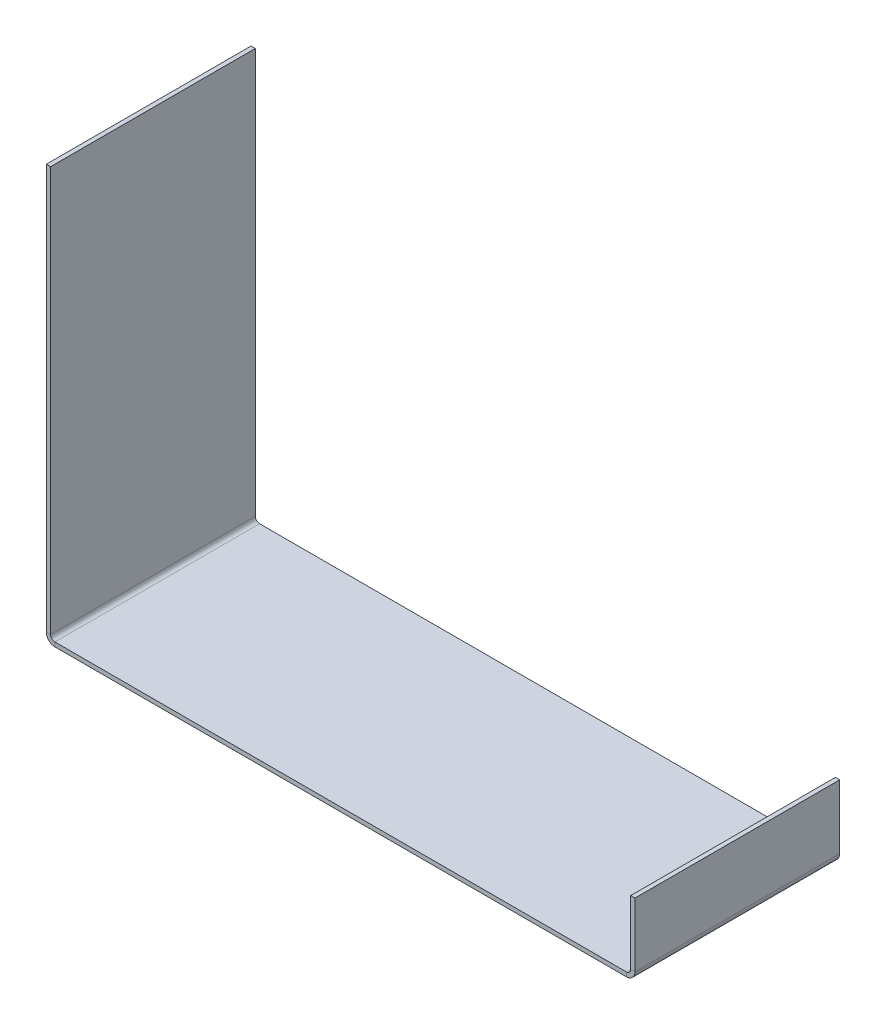
ISO-10303-21;
HEADER;
FILE_DESCRIPTION(('STEP AP214'),'2;1');
FILE_NAME('part.step','',(''),(''),'','','');
FILE_SCHEMA(('AUTOMOTIVE_DESIGN { 1 0 10303 214 1 1 1 1 }'));
ENDSEC;
DATA;
#1=APPLICATION_CONTEXT('core data for automotive mechanical design processes');
#2=APPLICATION_PROTOCOL_DEFINITION('international standard','automotive_design',2000,#1);
#3=PRODUCT_CONTEXT('',#1,'mechanical');
#4=PRODUCT('Part','Part','',(#3));
#5=PRODUCT_RELATED_PRODUCT_CATEGORY('part','',(#4));
#6=PRODUCT_DEFINITION_FORMATION('','',#4);
#7=PRODUCT_DEFINITION_CONTEXT('part definition',#1,'design');
#8=PRODUCT_DEFINITION('design','',#6,#7);
#9=PRODUCT_DEFINITION_SHAPE('','',#8);
#10=(LENGTH_UNIT() NAMED_UNIT(*) SI_UNIT(.MILLI.,.METRE.));
#11=(NAMED_UNIT(*) PLANE_ANGLE_UNIT() SI_UNIT($,.RADIAN.));
#12=(NAMED_UNIT(*) SI_UNIT($,.STERADIAN.) SOLID_ANGLE_UNIT());
#13=UNCERTAINTY_MEASURE_WITH_UNIT(LENGTH_MEASURE(1.E-05),#10,'distance_accuracy_value','');
#14=(GEOMETRIC_REPRESENTATION_CONTEXT(3) GLOBAL_UNCERTAINTY_ASSIGNED_CONTEXT((#13)) GLOBAL_UNIT_ASSIGNED_CONTEXT((#10,
#11,#12)) REPRESENTATION_CONTEXT('',''));
#15=CARTESIAN_POINT('',(0.,0.,0.));
#16=DIRECTION('',(0.,0.,1.));
#17=DIRECTION('',(1.,0.,0.));
#18=AXIS2_PLACEMENT_3D('',#15,#16,#17);
#19=CARTESIAN_POINT('',(0.,-1.5875,0.));
#20=DIRECTION('',(0.,1.,0.));
#21=DIRECTION('',(0.,0.,1.));
#22=AXIS2_PLACEMENT_3D('',#19,#20,#21);
#23=PLANE('',#22);
#24=DIRECTION('',(0.,0.,-1.));
#25=VECTOR('',#24,1.);
#26=CARTESIAN_POINT('',(106.3625,-1.58750000000001,-38.1));
#27=LINE('',#26,#25);
#28=CARTESIAN_POINT('',(106.3625,-1.58750000000001,-38.1));
#29=VERTEX_POINT('',#28);
#30=CARTESIAN_POINT('',(106.3625,-1.5875,38.1));
#31=VERTEX_POINT('',#30);
#32=EDGE_CURVE('E139',#29,#31,#27,.F.);
#33=ORIENTED_EDGE('',*,*,#32,.T.);
#34=DIRECTION('',(1.,0.,0.));
#35=VECTOR('',#34,1.);
#36=CARTESIAN_POINT('',(-107.95,-1.5875,38.1));
#37=LINE('',#36,#35);
#38=CARTESIAN_POINT('',(-106.3625,-1.58750000000001,38.1));
#39=VERTEX_POINT('',#38);
#40=EDGE_CURVE('E11',#39,#31,#37,.T.);
#41=ORIENTED_EDGE('',*,*,#40,.F.);
#42=DIRECTION('',(0.,0.,1.));
#43=VECTOR('',#42,1.);
#44=CARTESIAN_POINT('',(-106.3625,-1.58750000000001,38.1));
#45=LINE('',#44,#43);
#46=CARTESIAN_POINT('',(-106.3625,-1.5875,-38.1));
#47=VERTEX_POINT('',#46);
#48=EDGE_CURVE('E229',#39,#47,#45,.F.);
#49=ORIENTED_EDGE('',*,*,#48,.T.);
#50=DIRECTION('',(-1.,0.,0.));
#51=VECTOR('',#50,1.);
#52=CARTESIAN_POINT('',(-107.95,-1.5875,-38.1));
#53=LINE('',#52,#51);
#54=EDGE_CURVE('E49',#29,#47,#53,.T.);
#55=ORIENTED_EDGE('',*,*,#54,.F.);
#56=EDGE_LOOP('',(#33,#41,#49,#55));
#57=FACE_BOUND('',#56,.T.);
#58=ADVANCED_FACE('F40',(#57),#23,.F.);
#59=CARTESIAN_POINT('',(0.,0.,0.));
#60=DIRECTION('',(0.,1.,0.));
#61=DIRECTION('',(0.,0.,1.));
#62=AXIS2_PLACEMENT_3D('',#59,#60,#61);
#63=PLANE('',#62);
#64=DIRECTION('',(1.,0.,0.));
#65=VECTOR('',#64,1.);
#66=CARTESIAN_POINT('',(-107.95,0.,38.1));
#67=LINE('',#66,#65);
#68=CARTESIAN_POINT('',(-106.3625,0.,38.1));
#69=VERTEX_POINT('',#68);
#70=CARTESIAN_POINT('',(106.3625,0.,38.1));
#71=VERTEX_POINT('',#70);
#72=EDGE_CURVE('E44',#69,#71,#67,.T.);
#73=ORIENTED_EDGE('',*,*,#72,.T.);
#74=DIRECTION('',(0.,0.,-1.));
#75=VECTOR('',#74,1.);
#76=CARTESIAN_POINT('',(106.3625,0.,-38.1));
#77=LINE('',#76,#75);
#78=CARTESIAN_POINT('',(106.3625,0.,-38.1));
#79=VERTEX_POINT('',#78);
#80=EDGE_CURVE('E190',#79,#71,#77,.F.);
#81=ORIENTED_EDGE('',*,*,#80,.F.);
#82=DIRECTION('',(-1.,0.,0.));
#83=VECTOR('',#82,1.);
#84=CARTESIAN_POINT('',(-107.95,0.,-38.1));
#85=LINE('',#84,#83);
#86=CARTESIAN_POINT('',(-106.3625,0.,-38.1));
#87=VERTEX_POINT('',#86);
#88=EDGE_CURVE('E247',#79,#87,#85,.T.);
#89=ORIENTED_EDGE('',*,*,#88,.T.);
#90=DIRECTION('',(0.,0.,1.));
#91=VECTOR('',#90,1.);
#92=CARTESIAN_POINT('',(-106.3625,0.,38.1));
#93=LINE('',#92,#91);
#94=EDGE_CURVE('E57',#69,#87,#93,.F.);
#95=ORIENTED_EDGE('',*,*,#94,.F.);
#96=EDGE_LOOP('',(#73,#81,#89,#95));
#97=FACE_BOUND('',#96,.T.);
#98=ADVANCED_FACE('F251',(#97),#63,.T.);
#99=CARTESIAN_POINT('',(-107.95,-1.5875,-38.1));
#100=DIRECTION('',(0.,0.,-1.));
#101=DIRECTION('',(-1.,0.,0.));
#102=AXIS2_PLACEMENT_3D('',#99,#100,#101);
#103=PLANE('',#102);
#104=ORIENTED_EDGE('',*,*,#88,.F.);
#105=DIRECTION('',(0.,-1.,0.));
#106=VECTOR('',#105,1.);
#107=CARTESIAN_POINT('',(106.3625,0.,-38.1));
#108=LINE('',#107,#106);
#109=EDGE_CURVE('E186',#79,#29,#108,.T.);
#110=ORIENTED_EDGE('',*,*,#109,.T.);
#111=ORIENTED_EDGE('',*,*,#54,.T.);
#112=DIRECTION('',(0.,-1.,0.));
#113=VECTOR('',#112,1.);
#114=CARTESIAN_POINT('',(-106.3625,0.,-38.1));
#115=LINE('',#114,#113);
#116=EDGE_CURVE('E244',#87,#47,#115,.T.);
#117=ORIENTED_EDGE('',*,*,#116,.F.);
#118=EDGE_LOOP('',(#104,#110,#111,#117));
#119=FACE_BOUND('',#118,.T.);
#120=ADVANCED_FACE('F42',(#119),#103,.T.);
#121=CARTESIAN_POINT('',(-107.95,-1.5875,38.1));
#122=DIRECTION('',(0.,0.,1.));
#123=DIRECTION('',(1.,0.,0.));
#124=AXIS2_PLACEMENT_3D('',#121,#122,#123);
#125=PLANE('',#124);
#126=DIRECTION('',(0.,-1.,0.));
#127=VECTOR('',#126,1.);
#128=CARTESIAN_POINT('',(106.3625,0.,38.1));
#129=LINE('',#128,#127);
#130=EDGE_CURVE('E194',#71,#31,#129,.T.);
#131=ORIENTED_EDGE('',*,*,#130,.F.);
#132=ORIENTED_EDGE('',*,*,#72,.F.);
#133=DIRECTION('',(0.,-1.,0.));
#134=VECTOR('',#133,1.);
#135=CARTESIAN_POINT('',(-106.3625,0.,38.1));
#136=LINE('',#135,#134);
#137=EDGE_CURVE('E235',#69,#39,#136,.T.);
#138=ORIENTED_EDGE('',*,*,#137,.T.);
#139=ORIENTED_EDGE('',*,*,#40,.T.);
#140=EDGE_LOOP('',(#131,#132,#138,#139));
#141=FACE_BOUND('',#140,.T.);
#142=ADVANCED_FACE('F290',(#141),#125,.T.);
#143=CARTESIAN_POINT('',(-106.3625,1.5875,-38.1));
#144=DIRECTION('',(0.,0.,-1.));
#145=DIRECTION('',(-1.,0.,0.));
#146=AXIS2_PLACEMENT_3D('',#143,#144,#145);
#147=PLANE('',#146);
#148=DIRECTION('',(-1.,0.,0.));
#149=VECTOR('',#148,1.);
#150=CARTESIAN_POINT('',(-107.95,1.58749999999999,-38.1));
#151=LINE('',#150,#149);
#152=CARTESIAN_POINT('',(-107.95,1.58749999999999,-38.1));
#153=VERTEX_POINT('',#152);
#154=CARTESIAN_POINT('',(-109.5375,1.58749999999999,-38.1));
#155=VERTEX_POINT('',#154);
#156=EDGE_CURVE('E197',#153,#155,#151,.T.);
#157=ORIENTED_EDGE('',*,*,#156,.F.);
#158=CARTESIAN_POINT('',(-106.3625,1.5875,-38.1));
#159=DIRECTION('',(0.,0.,1.));
#160=DIRECTION('',(1.,0.,0.));
#161=AXIS2_PLACEMENT_3D('',#158,#159,#160);
#162=CIRCLE('',#161,1.58750000000001);
#163=EDGE_CURVE('E238',#87,#153,#162,.F.);
#164=ORIENTED_EDGE('',*,*,#163,.F.);
#165=ORIENTED_EDGE('',*,*,#116,.T.);
#166=CARTESIAN_POINT('',(-106.3625,1.5875,-38.1));
#167=DIRECTION('',(0.,0.,1.));
#168=DIRECTION('',(1.,0.,0.));
#169=AXIS2_PLACEMENT_3D('',#166,#167,#168);
#170=CIRCLE('',#169,3.17500000000001);
#171=EDGE_CURVE('E231',#47,#155,#170,.F.);
#172=ORIENTED_EDGE('',*,*,#171,.T.);
#173=EDGE_LOOP('',(#157,#164,#165,#172));
#174=FACE_BOUND('',#173,.T.);
#175=ADVANCED_FACE('F292',(#174),#147,.T.);
#176=CARTESIAN_POINT('',(-106.3625,1.5875,38.1));
#177=DIRECTION('',(0.,0.,-1.));
#178=DIRECTION('',(-1.,0.,0.));
#179=AXIS2_PLACEMENT_3D('',#176,#177,#178);
#180=PLANE('',#179);
#181=CARTESIAN_POINT('',(-106.3625,1.5875,38.1));
#182=DIRECTION('',(0.,0.,1.));
#183=DIRECTION('',(1.,0.,0.));
#184=AXIS2_PLACEMENT_3D('',#181,#182,#183);
#185=CIRCLE('',#184,1.58750000000001);
#186=CARTESIAN_POINT('',(-107.95,1.58749999999999,38.1));
#187=VERTEX_POINT('',#186);
#188=EDGE_CURVE('E228',#187,#69,#185,.T.);
#189=ORIENTED_EDGE('',*,*,#188,.F.);
#190=DIRECTION('',(-1.,0.,0.));
#191=VECTOR('',#190,1.);
#192=CARTESIAN_POINT('',(-107.95,1.58749999999999,38.1));
#193=LINE('',#192,#191);
#194=CARTESIAN_POINT('',(-109.5375,1.58749999999999,38.1));
#195=VERTEX_POINT('',#194);
#196=EDGE_CURVE('E201',#187,#195,#193,.T.);
#197=ORIENTED_EDGE('',*,*,#196,.T.);
#198=CARTESIAN_POINT('',(-106.3625,1.5875,38.1));
#199=DIRECTION('',(0.,0.,1.));
#200=DIRECTION('',(1.,0.,0.));
#201=AXIS2_PLACEMENT_3D('',#198,#199,#200);
#202=CIRCLE('',#201,3.17500000000001);
#203=EDGE_CURVE('E232',#195,#39,#202,.T.);
#204=ORIENTED_EDGE('',*,*,#203,.T.);
#205=ORIENTED_EDGE('',*,*,#137,.F.);
#206=EDGE_LOOP('',(#189,#197,#204,#205));
#207=FACE_BOUND('',#206,.T.);
#208=ADVANCED_FACE('F288',(#207),#180,.F.);
#209=CARTESIAN_POINT('',(-106.3625,1.5875,38.1));
#210=DIRECTION('',(0.,0.,1.));
#211=DIRECTION('',(-1.,0.,0.));
#212=AXIS2_PLACEMENT_3D('',#209,#210,#211);
#213=CYLINDRICAL_SURFACE('',#212,3.17500000000001);
#214=ORIENTED_EDGE('',*,*,#48,.F.);
#215=ORIENTED_EDGE('',*,*,#203,.F.);
#216=DIRECTION('',(0.,0.,-1.));
#217=VECTOR('',#216,1.);
#218=CARTESIAN_POINT('',(-109.5375,1.58749999999999,0.));
#219=LINE('',#218,#217);
#220=EDGE_CURVE('E204',#195,#155,#219,.T.);
#221=ORIENTED_EDGE('',*,*,#220,.T.);
#222=ORIENTED_EDGE('',*,*,#171,.F.);
#223=EDGE_LOOP('',(#214,#215,#221,#222));
#224=FACE_BOUND('',#223,.T.);
#225=ADVANCED_FACE('F333',(#224),#213,.T.);
#226=CARTESIAN_POINT('',(-106.3625,1.5875,38.1));
#227=DIRECTION('',(0.,0.,1.));
#228=DIRECTION('',(-1.,0.,0.));
#229=AXIS2_PLACEMENT_3D('',#226,#227,#228);
#230=CYLINDRICAL_SURFACE('',#229,1.58750000000001);
#231=ORIENTED_EDGE('',*,*,#94,.T.);
#232=ORIENTED_EDGE('',*,*,#163,.T.);
#233=DIRECTION('',(0.,0.,1.));
#234=VECTOR('',#233,1.);
#235=CARTESIAN_POINT('',(-107.95,1.58749999999999,-38.1));
#236=LINE('',#235,#234);
#237=EDGE_CURVE('E199',#153,#187,#236,.T.);
#238=ORIENTED_EDGE('',*,*,#237,.T.);
#239=ORIENTED_EDGE('',*,*,#188,.T.);
#240=EDGE_LOOP('',(#231,#232,#238,#239));
#241=FACE_BOUND('',#240,.T.);
#242=ADVANCED_FACE('F302',(#241),#230,.F.);
#243=CARTESIAN_POINT('',(-109.537500000001,152.4,38.1));
#244=DIRECTION('',(0.,0.,-1.));
#245=DIRECTION('',(-1.,0.,0.));
#246=AXIS2_PLACEMENT_3D('',#243,#244,#245);
#247=PLANE('',#246);
#248=ORIENTED_EDGE('',*,*,#196,.F.);
#249=DIRECTION('',(0.,1.,0.));
#250=VECTOR('',#249,1.);
#251=CARTESIAN_POINT('',(-107.950000000001,152.4,38.1));
#252=LINE('',#251,#250);
#253=CARTESIAN_POINT('',(-107.950000000001,152.4,38.1));
#254=VERTEX_POINT('',#253);
#255=EDGE_CURVE('E208',#187,#254,#252,.T.);
#256=ORIENTED_EDGE('',*,*,#255,.T.);
#257=DIRECTION('',(1.,0.,0.));
#258=VECTOR('',#257,1.);
#259=CARTESIAN_POINT('',(-109.537500000001,152.4,38.1));
#260=LINE('',#259,#258);
#261=CARTESIAN_POINT('',(-109.537500000001,152.4,38.1));
#262=VERTEX_POINT('',#261);
#263=EDGE_CURVE('E225',#262,#254,#260,.T.);
#264=ORIENTED_EDGE('',*,*,#263,.F.);
#265=DIRECTION('',(0.,1.,0.));
#266=VECTOR('',#265,1.);
#267=CARTESIAN_POINT('',(-109.537500000001,152.4,38.1));
#268=LINE('',#267,#266);
#269=EDGE_CURVE('E209',#195,#262,#268,.T.);
#270=ORIENTED_EDGE('',*,*,#269,.F.);
#271=EDGE_LOOP('',(#248,#256,#264,#270));
#272=FACE_BOUND('',#271,.T.);
#273=ADVANCED_FACE('F325',(#272),#247,.F.);
#274=CARTESIAN_POINT('',(-109.5375,0.,-38.1));
#275=DIRECTION('',(0.,0.,1.));
#276=DIRECTION('',(1.,0.,0.));
#277=AXIS2_PLACEMENT_3D('',#274,#275,#276);
#278=PLANE('',#277);
#279=ORIENTED_EDGE('',*,*,#156,.T.);
#280=DIRECTION('',(0.,-1.,0.));
#281=VECTOR('',#280,1.);
#282=CARTESIAN_POINT('',(-109.5375,0.,-38.1));
#283=LINE('',#282,#281);
#284=CARTESIAN_POINT('',(-109.537500000001,152.4,-38.1));
#285=VERTEX_POINT('',#284);
#286=EDGE_CURVE('E214',#285,#155,#283,.T.);
#287=ORIENTED_EDGE('',*,*,#286,.F.);
#288=DIRECTION('',(1.,0.,0.));
#289=VECTOR('',#288,1.);
#290=CARTESIAN_POINT('',(-109.537500000001,152.4,-38.1));
#291=LINE('',#290,#289);
#292=CARTESIAN_POINT('',(-107.950000000001,152.4,-38.1));
#293=VERTEX_POINT('',#292);
#294=EDGE_CURVE('E217',#285,#293,#291,.T.);
#295=ORIENTED_EDGE('',*,*,#294,.T.);
#296=DIRECTION('',(0.,-1.,0.));
#297=VECTOR('',#296,1.);
#298=CARTESIAN_POINT('',(-107.95,0.,-38.1));
#299=LINE('',#298,#297);
#300=EDGE_CURVE('E212',#293,#153,#299,.T.);
#301=ORIENTED_EDGE('',*,*,#300,.T.);
#302=EDGE_LOOP('',(#279,#287,#295,#301));
#303=FACE_BOUND('',#302,.T.);
#304=ADVANCED_FACE('F307',(#303),#278,.F.);
#305=CARTESIAN_POINT('',(-109.5375,-3.79086515119086E-13,0.));
#306=DIRECTION('',(1.,0.,0.));
#307=DIRECTION('',(0.,1.,0.));
#308=AXIS2_PLACEMENT_3D('',#305,#306,#307);
#309=PLANE('',#308);
#310=ORIENTED_EDGE('',*,*,#220,.F.);
#311=ORIENTED_EDGE('',*,*,#269,.T.);
#312=DIRECTION('',(0.,0.,-1.));
#313=VECTOR('',#312,1.);
#314=CARTESIAN_POINT('',(-109.537500000001,152.4,-38.1));
#315=LINE('',#314,#313);
#316=EDGE_CURVE('E211',#262,#285,#315,.T.);
#317=ORIENTED_EDGE('',*,*,#316,.T.);
#318=ORIENTED_EDGE('',*,*,#286,.T.);
#319=EDGE_LOOP('',(#310,#311,#317,#318));
#320=FACE_BOUND('',#319,.T.);
#321=ADVANCED_FACE('F311',(#320),#309,.F.);
#322=CARTESIAN_POINT('',(-107.95,-3.73543788493672E-13,0.));
#323=DIRECTION('',(1.,0.,0.));
#324=DIRECTION('',(0.,1.,0.));
#325=AXIS2_PLACEMENT_3D('',#322,#323,#324);
#326=PLANE('',#325);
#327=ORIENTED_EDGE('',*,*,#255,.F.);
#328=ORIENTED_EDGE('',*,*,#237,.F.);
#329=ORIENTED_EDGE('',*,*,#300,.F.);
#330=DIRECTION('',(0.,0.,-1.));
#331=VECTOR('',#330,1.);
#332=CARTESIAN_POINT('',(-107.950000000001,152.4,-38.1));
#333=LINE('',#332,#331);
#334=EDGE_CURVE('E219',#254,#293,#333,.T.);
#335=ORIENTED_EDGE('',*,*,#334,.F.);
#336=EDGE_LOOP('',(#327,#328,#329,#335));
#337=FACE_BOUND('',#336,.T.);
#338=ADVANCED_FACE('F321',(#337),#326,.T.);
#339=CARTESIAN_POINT('',(-109.537500000001,152.4,-38.1));
#340=DIRECTION('',(0.,-1.,0.));
#341=DIRECTION('',(1.,0.,0.));
#342=AXIS2_PLACEMENT_3D('',#339,#340,#341);
#343=PLANE('',#342);
#344=ORIENTED_EDGE('',*,*,#334,.T.);
#345=ORIENTED_EDGE('',*,*,#294,.F.);
#346=ORIENTED_EDGE('',*,*,#316,.F.);
#347=ORIENTED_EDGE('',*,*,#263,.T.);
#348=EDGE_LOOP('',(#344,#345,#346,#347));
#349=FACE_BOUND('',#348,.T.);
#350=ADVANCED_FACE('F317',(#349),#343,.F.);
#351=CARTESIAN_POINT('',(106.3625,1.5875,38.1));
#352=DIRECTION('',(0.,0.,1.));
#353=DIRECTION('',(1.,0.,0.));
#354=AXIS2_PLACEMENT_3D('',#351,#352,#353);
#355=PLANE('',#354);
#356=DIRECTION('',(1.,0.,0.));
#357=VECTOR('',#356,1.);
#358=CARTESIAN_POINT('',(107.95,1.58749999999999,38.1));
#359=LINE('',#358,#357);
#360=CARTESIAN_POINT('',(107.95,1.58749999999999,38.1));
#361=VERTEX_POINT('',#360);
#362=CARTESIAN_POINT('',(109.5375,1.58749999999999,38.1));
#363=VERTEX_POINT('',#362);
#364=EDGE_CURVE('E261',#361,#363,#359,.T.);
#365=ORIENTED_EDGE('',*,*,#364,.F.);
#366=CARTESIAN_POINT('',(106.3625,1.5875,38.1));
#367=DIRECTION('',(0.,0.,-1.));
#368=DIRECTION('',(-1.,0.,0.));
#369=AXIS2_PLACEMENT_3D('',#366,#367,#368);
#370=CIRCLE('',#369,1.58750000000001);
#371=EDGE_CURVE('E142',#71,#361,#370,.F.);
#372=ORIENTED_EDGE('',*,*,#371,.F.);
#373=ORIENTED_EDGE('',*,*,#130,.T.);
#374=CARTESIAN_POINT('',(106.3625,1.5875,38.1));
#375=DIRECTION('',(0.,0.,-1.));
#376=DIRECTION('',(-1.,0.,0.));
#377=AXIS2_PLACEMENT_3D('',#374,#375,#376);
#378=CIRCLE('',#377,3.17500000000001);
#379=EDGE_CURVE('E185',#31,#363,#378,.F.);
#380=ORIENTED_EDGE('',*,*,#379,.T.);
#381=EDGE_LOOP('',(#365,#372,#373,#380));
#382=FACE_BOUND('',#381,.T.);
#383=ADVANCED_FACE('F259',(#382),#355,.T.);
#384=CARTESIAN_POINT('',(106.3625,1.5875,-38.1));
#385=DIRECTION('',(0.,0.,1.));
#386=DIRECTION('',(1.,0.,0.));
#387=AXIS2_PLACEMENT_3D('',#384,#385,#386);
#388=PLANE('',#387);
#389=CARTESIAN_POINT('',(106.3625,1.5875,-38.1));
#390=DIRECTION('',(0.,0.,-1.));
#391=DIRECTION('',(-1.,0.,0.));
#392=AXIS2_PLACEMENT_3D('',#389,#390,#391);
#393=CIRCLE('',#392,1.58750000000001);
#394=CARTESIAN_POINT('',(107.95,1.58749999999999,-38.1));
#395=VERTEX_POINT('',#394);
#396=EDGE_CURVE('E149',#395,#79,#393,.T.);
#397=ORIENTED_EDGE('',*,*,#396,.F.);
#398=DIRECTION('',(1.,0.,0.));
#399=VECTOR('',#398,1.);
#400=CARTESIAN_POINT('',(107.95,1.58749999999999,-38.1));
#401=LINE('',#400,#399);
#402=CARTESIAN_POINT('',(109.5375,1.58749999999999,-38.1));
#403=VERTEX_POINT('',#402);
#404=EDGE_CURVE('E146',#395,#403,#401,.T.);
#405=ORIENTED_EDGE('',*,*,#404,.T.);
#406=CARTESIAN_POINT('',(106.3625,1.5875,-38.1));
#407=DIRECTION('',(0.,0.,-1.));
#408=DIRECTION('',(-1.,0.,0.));
#409=AXIS2_PLACEMENT_3D('',#406,#407,#408);
#410=CIRCLE('',#409,3.17500000000001);
#411=EDGE_CURVE('E132',#403,#29,#410,.T.);
#412=ORIENTED_EDGE('',*,*,#411,.T.);
#413=ORIENTED_EDGE('',*,*,#109,.F.);
#414=EDGE_LOOP('',(#397,#405,#412,#413));
#415=FACE_BOUND('',#414,.T.);
#416=ADVANCED_FACE('F147',(#415),#388,.F.);
#417=CARTESIAN_POINT('',(106.3625,1.5875,-38.1));
#418=DIRECTION('',(0.,0.,-1.));
#419=DIRECTION('',(1.,0.,0.));
#420=AXIS2_PLACEMENT_3D('',#417,#418,#419);
#421=CYLINDRICAL_SURFACE('',#420,3.17500000000001);
#422=ORIENTED_EDGE('',*,*,#32,.F.);
#423=ORIENTED_EDGE('',*,*,#411,.F.);
#424=DIRECTION('',(0.,0.,1.));
#425=VECTOR('',#424,1.);
#426=CARTESIAN_POINT('',(109.5375,1.58749999999999,0.));
#427=LINE('',#426,#425);
#428=EDGE_CURVE('E137',#403,#363,#427,.T.);
#429=ORIENTED_EDGE('',*,*,#428,.T.);
#430=ORIENTED_EDGE('',*,*,#379,.F.);
#431=EDGE_LOOP('',(#422,#423,#429,#430));
#432=FACE_BOUND('',#431,.T.);
#433=ADVANCED_FACE('F134',(#432),#421,.T.);
#434=CARTESIAN_POINT('',(106.3625,1.5875,-38.1));
#435=DIRECTION('',(0.,0.,-1.));
#436=DIRECTION('',(1.,0.,0.));
#437=AXIS2_PLACEMENT_3D('',#434,#435,#436);
#438=CYLINDRICAL_SURFACE('',#437,1.58750000000001);
#439=ORIENTED_EDGE('',*,*,#80,.T.);
#440=ORIENTED_EDGE('',*,*,#371,.T.);
#441=DIRECTION('',(0.,0.,-1.));
#442=VECTOR('',#441,1.);
#443=CARTESIAN_POINT('',(107.95,1.58749999999999,38.1));
#444=LINE('',#443,#442);
#445=EDGE_CURVE('E153',#361,#395,#444,.T.);
#446=ORIENTED_EDGE('',*,*,#445,.T.);
#447=ORIENTED_EDGE('',*,*,#396,.T.);
#448=EDGE_LOOP('',(#439,#440,#446,#447));
#449=FACE_BOUND('',#448,.T.);
#450=ADVANCED_FACE('F256',(#449),#438,.F.);
#451=CARTESIAN_POINT('',(109.5375,25.4,-38.1));
#452=DIRECTION('',(0.,0.,1.));
#453=DIRECTION('',(0.,-1.,0.));
#454=AXIS2_PLACEMENT_3D('',#451,#452,#453);
#455=PLANE('',#454);
#456=ORIENTED_EDGE('',*,*,#404,.F.);
#457=DIRECTION('',(0.,1.,0.));
#458=VECTOR('',#457,1.);
#459=CARTESIAN_POINT('',(107.95,25.4,-38.1));
#460=LINE('',#459,#458);
#461=CARTESIAN_POINT('',(107.95,25.4,-38.1));
#462=VERTEX_POINT('',#461);
#463=EDGE_CURVE('E162',#395,#462,#460,.T.);
#464=ORIENTED_EDGE('',*,*,#463,.T.);
#465=DIRECTION('',(-1.,0.,0.));
#466=VECTOR('',#465,1.);
#467=CARTESIAN_POINT('',(109.5375,25.4,-38.1));
#468=LINE('',#467,#466);
#469=CARTESIAN_POINT('',(109.5375,25.4,-38.1));
#470=VERTEX_POINT('',#469);
#471=EDGE_CURVE('E166',#470,#462,#468,.T.);
#472=ORIENTED_EDGE('',*,*,#471,.F.);
#473=DIRECTION('',(0.,1.,0.));
#474=VECTOR('',#473,1.);
#475=CARTESIAN_POINT('',(109.5375,25.4,-38.1));
#476=LINE('',#475,#474);
#477=EDGE_CURVE('E158',#403,#470,#476,.T.);
#478=ORIENTED_EDGE('',*,*,#477,.F.);
#479=EDGE_LOOP('',(#456,#464,#472,#478));
#480=FACE_BOUND('',#479,.T.);
#481=ADVANCED_FACE('F164',(#480),#455,.F.);
#482=CARTESIAN_POINT('',(109.5375,0.,38.1));
#483=DIRECTION('',(0.,0.,-1.));
#484=DIRECTION('',(0.,1.,0.));
#485=AXIS2_PLACEMENT_3D('',#482,#483,#484);
#486=PLANE('',#485);
#487=ORIENTED_EDGE('',*,*,#364,.T.);
#488=DIRECTION('',(0.,-1.,0.));
#489=VECTOR('',#488,1.);
#490=CARTESIAN_POINT('',(109.5375,0.,38.1));
#491=LINE('',#490,#489);
#492=CARTESIAN_POINT('',(109.5375,25.4,38.1));
#493=VERTEX_POINT('',#492);
#494=EDGE_CURVE('E161',#493,#363,#491,.T.);
#495=ORIENTED_EDGE('',*,*,#494,.F.);
#496=DIRECTION('',(-1.,0.,0.));
#497=VECTOR('',#496,1.);
#498=CARTESIAN_POINT('',(109.5375,25.4,38.1));
#499=LINE('',#498,#497);
#500=CARTESIAN_POINT('',(107.95,25.4,38.1));
#501=VERTEX_POINT('',#500);
#502=EDGE_CURVE('E178',#493,#501,#499,.T.);
#503=ORIENTED_EDGE('',*,*,#502,.T.);
#504=DIRECTION('',(0.,-1.,0.));
#505=VECTOR('',#504,1.);
#506=CARTESIAN_POINT('',(107.95,0.,38.1));
#507=LINE('',#506,#505);
#508=EDGE_CURVE('E169',#501,#361,#507,.T.);
#509=ORIENTED_EDGE('',*,*,#508,.T.);
#510=EDGE_LOOP('',(#487,#495,#503,#509));
#511=FACE_BOUND('',#510,.T.);
#512=ADVANCED_FACE('F268',(#511),#486,.F.);
#513=CARTESIAN_POINT('',(109.5375,-3.59426315724682E-13,0.));
#514=DIRECTION('',(-1.,0.,0.));
#515=DIRECTION('',(0.,-1.,0.));
#516=AXIS2_PLACEMENT_3D('',#513,#514,#515);
#517=PLANE('',#516);
#518=ORIENTED_EDGE('',*,*,#428,.F.);
#519=ORIENTED_EDGE('',*,*,#477,.T.);
#520=DIRECTION('',(0.,0.,1.));
#521=VECTOR('',#520,1.);
#522=CARTESIAN_POINT('',(109.5375,25.4,38.1));
#523=LINE('',#522,#521);
#524=EDGE_CURVE('E168',#470,#493,#523,.T.);
#525=ORIENTED_EDGE('',*,*,#524,.T.);
#526=ORIENTED_EDGE('',*,*,#494,.T.);
#527=EDGE_LOOP('',(#518,#519,#525,#526));
#528=FACE_BOUND('',#527,.T.);
#529=ADVANCED_FACE('F157',(#528),#517,.F.);
#530=CARTESIAN_POINT('',(107.95,-3.53883589099269E-13,0.));
#531=DIRECTION('',(-1.,0.,0.));
#532=DIRECTION('',(0.,-1.,0.));
#533=AXIS2_PLACEMENT_3D('',#530,#531,#532);
#534=PLANE('',#533);
#535=ORIENTED_EDGE('',*,*,#463,.F.);
#536=ORIENTED_EDGE('',*,*,#445,.F.);
#537=ORIENTED_EDGE('',*,*,#508,.F.);
#538=DIRECTION('',(0.,0.,1.));
#539=VECTOR('',#538,1.);
#540=CARTESIAN_POINT('',(107.95,25.4,38.1));
#541=LINE('',#540,#539);
#542=EDGE_CURVE('E173',#462,#501,#541,.T.);
#543=ORIENTED_EDGE('',*,*,#542,.F.);
#544=EDGE_LOOP('',(#535,#536,#537,#543));
#545=FACE_BOUND('',#544,.T.);
#546=ADVANCED_FACE('F266',(#545),#534,.T.);
#547=CARTESIAN_POINT('',(109.5375,25.4,38.1));
#548=DIRECTION('',(0.,-1.,0.));
#549=DIRECTION('',(1.,0.,0.));
#550=AXIS2_PLACEMENT_3D('',#547,#548,#549);
#551=PLANE('',#550);
#552=ORIENTED_EDGE('',*,*,#542,.T.);
#553=ORIENTED_EDGE('',*,*,#502,.F.);
#554=ORIENTED_EDGE('',*,*,#524,.F.);
#555=ORIENTED_EDGE('',*,*,#471,.T.);
#556=EDGE_LOOP('',(#552,#553,#554,#555));
#557=FACE_BOUND('',#556,.T.);
#558=ADVANCED_FACE('F271',(#557),#551,.F.);
#559=CLOSED_SHELL('',(#58,#98,#120,#142,#175,#208,#225,#242,#273,#304,#321,#338,#350,#383,#416,
#433,#450,#481,#512,#529,#546,#558));
#560=MANIFOLD_SOLID_BREP('B2',#559);
#561=ADVANCED_BREP_SHAPE_REPRESENTATION('',(#18,#560),#14);
#562=SHAPE_DEFINITION_REPRESENTATION(#9,#561);
ENDSEC;
END-ISO-10303-21;
